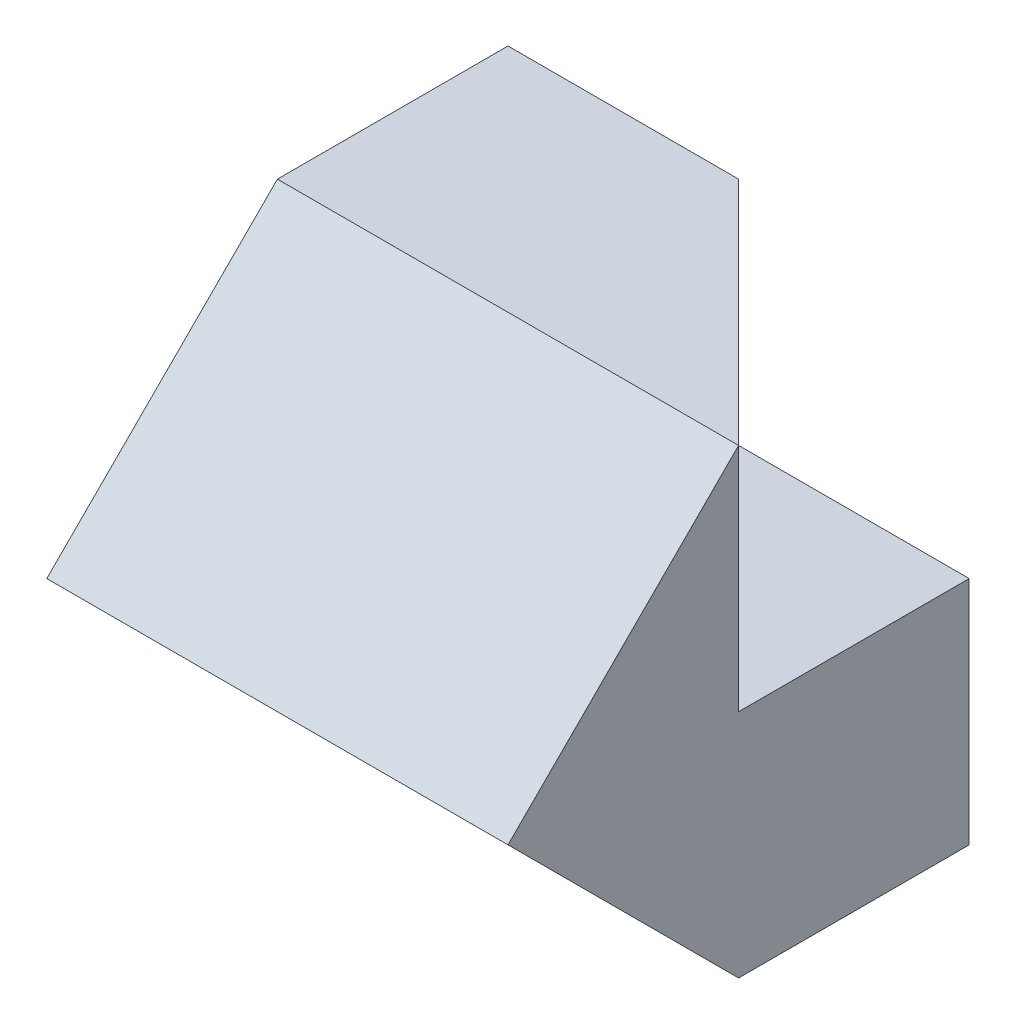
ISO-10303-21;
HEADER;
FILE_DESCRIPTION(('STEP AP214'),'2;1');
FILE_NAME('part.step','',(''),(''),'','','');
FILE_SCHEMA(('AUTOMOTIVE_DESIGN { 1 0 10303 214 1 1 1 1 }'));
ENDSEC;
DATA;
#1=APPLICATION_CONTEXT('core data for automotive mechanical design processes');
#2=APPLICATION_PROTOCOL_DEFINITION('international standard','automotive_design',2000,#1);
#3=PRODUCT_CONTEXT('',#1,'mechanical');
#4=PRODUCT('Part','Part','',(#3));
#5=PRODUCT_RELATED_PRODUCT_CATEGORY('part','',(#4));
#6=PRODUCT_DEFINITION_FORMATION('','',#4);
#7=PRODUCT_DEFINITION_CONTEXT('part definition',#1,'design');
#8=PRODUCT_DEFINITION('design','',#6,#7);
#9=PRODUCT_DEFINITION_SHAPE('','',#8);
#10=(LENGTH_UNIT() NAMED_UNIT(*) SI_UNIT(.MILLI.,.METRE.));
#11=(NAMED_UNIT(*) PLANE_ANGLE_UNIT() SI_UNIT($,.RADIAN.));
#12=(NAMED_UNIT(*) SI_UNIT($,.STERADIAN.) SOLID_ANGLE_UNIT());
#13=UNCERTAINTY_MEASURE_WITH_UNIT(LENGTH_MEASURE(1.E-05),#10,'distance_accuracy_value','');
#14=(GEOMETRIC_REPRESENTATION_CONTEXT(3) GLOBAL_UNCERTAINTY_ASSIGNED_CONTEXT((#13)) GLOBAL_UNIT_ASSIGNED_CONTEXT((#10,
#11,#12)) REPRESENTATION_CONTEXT('',''));
#15=CARTESIAN_POINT('',(0.,0.,0.));
#16=DIRECTION('',(0.,0.,1.));
#17=DIRECTION('',(1.,0.,0.));
#18=AXIS2_PLACEMENT_3D('',#15,#16,#17);
#19=CARTESIAN_POINT('',(0.,0.,0.));
#20=DIRECTION('',(0.,0.,-1.));
#21=DIRECTION('',(-1.,0.,0.));
#22=AXIS2_PLACEMENT_3D('',#19,#20,#21);
#23=PLANE('',#22);
#24=DIRECTION('',(0.,-1.,0.));
#25=VECTOR('',#24,1.);
#26=CARTESIAN_POINT('',(0.,0.,0.));
#27=LINE('',#26,#25);
#28=CARTESIAN_POINT('',(0.,2.,0.));
#29=VERTEX_POINT('',#28);
#30=CARTESIAN_POINT('',(0.,0.,0.));
#31=VERTEX_POINT('',#30);
#32=EDGE_CURVE('E101',#29,#31,#27,.T.);
#33=ORIENTED_EDGE('',*,*,#32,.F.);
#34=DIRECTION('',(-1.,0.,0.));
#35=VECTOR('',#34,1.);
#36=CARTESIAN_POINT('',(0.,2.,0.));
#37=LINE('',#36,#35);
#38=CARTESIAN_POINT('',(2.,2.,0.));
#39=VERTEX_POINT('',#38);
#40=EDGE_CURVE('E123',#39,#29,#37,.T.);
#41=ORIENTED_EDGE('',*,*,#40,.F.);
#42=DIRECTION('',(0.,1.,0.));
#43=VECTOR('',#42,1.);
#44=CARTESIAN_POINT('',(2.,4.,0.));
#45=LINE('',#44,#43);
#46=CARTESIAN_POINT('',(2.,0.,0.));
#47=VERTEX_POINT('',#46);
#48=EDGE_CURVE('E127',#47,#39,#45,.T.);
#49=ORIENTED_EDGE('',*,*,#48,.F.);
#50=DIRECTION('',(1.,0.,0.));
#51=VECTOR('',#50,1.);
#52=CARTESIAN_POINT('',(2.,0.,0.));
#53=LINE('',#52,#51);
#54=EDGE_CURVE('E126',#31,#47,#53,.T.);
#55=ORIENTED_EDGE('',*,*,#54,.F.);
#56=EDGE_LOOP('',(#33,#41,#49,#55));
#57=FACE_BOUND('',#56,.T.);
#58=ADVANCED_FACE('F34',(#57),#23,.T.);
#59=CARTESIAN_POINT('',(2.,0.,4.));
#60=DIRECTION('',(0.,1.,0.));
#61=DIRECTION('',(-1.,0.,0.));
#62=AXIS2_PLACEMENT_3D('',#59,#60,#61);
#63=PLANE('',#62);
#64=DIRECTION('',(0.,0.,-1.));
#65=VECTOR('',#64,1.);
#66=CARTESIAN_POINT('',(2.,0.,4.));
#67=LINE('',#66,#65);
#68=CARTESIAN_POINT('',(2.,0.,2.));
#69=VERTEX_POINT('',#68);
#70=EDGE_CURVE('E12',#69,#47,#67,.T.);
#71=ORIENTED_EDGE('',*,*,#70,.F.);
#72=DIRECTION('',(-1.,0.,0.));
#73=VECTOR('',#72,1.);
#74=CARTESIAN_POINT('',(2.,0.,2.));
#75=LINE('',#74,#73);
#76=CARTESIAN_POINT('',(0.,0.,2.));
#77=VERTEX_POINT('',#76);
#78=EDGE_CURVE('E167',#69,#77,#75,.T.);
#79=ORIENTED_EDGE('',*,*,#78,.T.);
#80=DIRECTION('',(0.,0.,-1.));
#81=VECTOR('',#80,1.);
#82=CARTESIAN_POINT('',(0.,0.,4.));
#83=LINE('',#82,#81);
#84=EDGE_CURVE('E107',#77,#31,#83,.T.);
#85=ORIENTED_EDGE('',*,*,#84,.T.);
#86=ORIENTED_EDGE('',*,*,#54,.T.);
#87=EDGE_LOOP('',(#71,#79,#85,#86));
#88=FACE_BOUND('',#87,.T.);
#89=ADVANCED_FACE('F36',(#88),#63,.F.);
#90=CARTESIAN_POINT('',(2.,4.,4.));
#91=DIRECTION('',(-1.,0.,0.));
#92=DIRECTION('',(0.,-1.,0.));
#93=AXIS2_PLACEMENT_3D('',#90,#91,#92);
#94=PLANE('',#93);
#95=DIRECTION('',(0.,0.,-1.));
#96=VECTOR('',#95,1.);
#97=CARTESIAN_POINT('',(2.,2.,0.));
#98=LINE('',#97,#96);
#99=CARTESIAN_POINT('',(2.,2.,2.));
#100=VERTEX_POINT('',#99);
#101=EDGE_CURVE('E49',#100,#39,#98,.T.);
#102=ORIENTED_EDGE('',*,*,#101,.F.);
#103=DIRECTION('',(0.,1.,0.));
#104=VECTOR('',#103,1.);
#105=CARTESIAN_POINT('',(2.,2.,2.));
#106=LINE('',#105,#104);
#107=CARTESIAN_POINT('',(2.,4.,2.));
#108=VERTEX_POINT('',#107);
#109=EDGE_CURVE('E173',#100,#108,#106,.T.);
#110=ORIENTED_EDGE('',*,*,#109,.T.);
#111=DIRECTION('',(0.,-0.707106781186548,0.707106781186548));
#112=VECTOR('',#111,1.);
#113=CARTESIAN_POINT('',(2.,3.,3.));
#114=LINE('',#113,#112);
#115=CARTESIAN_POINT('',(2.,2.,4.));
#116=VERTEX_POINT('',#115);
#117=EDGE_CURVE('E164',#108,#116,#114,.T.);
#118=ORIENTED_EDGE('',*,*,#117,.T.);
#119=DIRECTION('',(0.,-0.707106781186547,-0.707106781186548));
#120=VECTOR('',#119,1.);
#121=CARTESIAN_POINT('',(2.,-1.,1.));
#122=LINE('',#121,#120);
#123=EDGE_CURVE('E159',#116,#69,#122,.T.);
#124=ORIENTED_EDGE('',*,*,#123,.T.);
#125=ORIENTED_EDGE('',*,*,#70,.T.);
#126=ORIENTED_EDGE('',*,*,#48,.T.);
#127=EDGE_LOOP('',(#102,#110,#118,#124,#125,#126));
#128=FACE_BOUND('',#127,.T.);
#129=ADVANCED_FACE('F185',(#128),#94,.F.);
#130=CARTESIAN_POINT('',(-2.,4.,4.));
#131=DIRECTION('',(0.,-1.,0.));
#132=DIRECTION('',(0.,0.,-1.));
#133=AXIS2_PLACEMENT_3D('',#130,#131,#132);
#134=PLANE('',#133);
#135=DIRECTION('',(-1.,0.,0.));
#136=VECTOR('',#135,1.);
#137=CARTESIAN_POINT('',(2.,4.,2.));
#138=LINE('',#137,#136);
#139=CARTESIAN_POINT('',(-2.,4.,2.));
#140=VERTEX_POINT('',#139);
#141=EDGE_CURVE('E134',#108,#140,#138,.T.);
#142=ORIENTED_EDGE('',*,*,#141,.F.);
#143=DIRECTION('',(0.707106781186548,0.,0.707106781186547));
#144=VECTOR('',#143,1.);
#145=CARTESIAN_POINT('',(2.,4.,2.));
#146=LINE('',#145,#144);
#147=CARTESIAN_POINT('',(0.,4.,0.));
#148=VERTEX_POINT('',#147);
#149=EDGE_CURVE('E144',#148,#108,#146,.T.);
#150=ORIENTED_EDGE('',*,*,#149,.F.);
#151=DIRECTION('',(-1.,0.,0.));
#152=VECTOR('',#151,1.);
#153=CARTESIAN_POINT('',(-2.,4.,0.));
#154=LINE('',#153,#152);
#155=CARTESIAN_POINT('',(-2.,4.,0.));
#156=VERTEX_POINT('',#155);
#157=EDGE_CURVE('E86',#148,#156,#154,.T.);
#158=ORIENTED_EDGE('',*,*,#157,.T.);
#159=DIRECTION('',(0.,0.,-1.));
#160=VECTOR('',#159,1.);
#161=CARTESIAN_POINT('',(-2.,4.,4.));
#162=LINE('',#161,#160);
#163=EDGE_CURVE('E42',#140,#156,#162,.T.);
#164=ORIENTED_EDGE('',*,*,#163,.F.);
#165=EDGE_LOOP('',(#142,#150,#158,#164));
#166=FACE_BOUND('',#165,.T.);
#167=ADVANCED_FACE('F141',(#166),#134,.F.);
#168=CARTESIAN_POINT('',(-2.,2.,4.));
#169=DIRECTION('',(1.,0.,0.));
#170=DIRECTION('',(0.,0.,-1.));
#171=AXIS2_PLACEMENT_3D('',#168,#169,#170);
#172=PLANE('',#171);
#173=DIRECTION('',(0.,0.,-1.));
#174=VECTOR('',#173,1.);
#175=CARTESIAN_POINT('',(-2.,2.,4.));
#176=LINE('',#175,#174);
#177=CARTESIAN_POINT('',(-2.,2.,4.));
#178=VERTEX_POINT('',#177);
#179=CARTESIAN_POINT('',(-2.,2.,0.));
#180=VERTEX_POINT('',#179);
#181=EDGE_CURVE('E79',#178,#180,#176,.T.);
#182=ORIENTED_EDGE('',*,*,#181,.F.);
#183=DIRECTION('',(0.,-0.707106781186548,0.707106781186548));
#184=VECTOR('',#183,1.);
#185=CARTESIAN_POINT('',(-2.,3.,3.));
#186=LINE('',#185,#184);
#187=EDGE_CURVE('E58',#140,#178,#186,.T.);
#188=ORIENTED_EDGE('',*,*,#187,.F.);
#189=ORIENTED_EDGE('',*,*,#163,.T.);
#190=DIRECTION('',(0.,-1.,0.));
#191=VECTOR('',#190,1.);
#192=CARTESIAN_POINT('',(-2.,2.,0.));
#193=LINE('',#192,#191);
#194=EDGE_CURVE('E76',#156,#180,#193,.T.);
#195=ORIENTED_EDGE('',*,*,#194,.T.);
#196=EDGE_LOOP('',(#182,#188,#189,#195));
#197=FACE_BOUND('',#196,.T.);
#198=ADVANCED_FACE('F78',(#197),#172,.F.);
#199=CARTESIAN_POINT('',(0.,2.,4.));
#200=DIRECTION('',(0.,1.,0.));
#201=DIRECTION('',(-1.,0.,0.));
#202=AXIS2_PLACEMENT_3D('',#199,#200,#201);
#203=PLANE('',#202);
#204=DIRECTION('',(1.,0.,0.));
#205=VECTOR('',#204,1.);
#206=CARTESIAN_POINT('',(0.,2.,0.));
#207=LINE('',#206,#205);
#208=EDGE_CURVE('E85',#180,#29,#207,.T.);
#209=ORIENTED_EDGE('',*,*,#208,.T.);
#210=DIRECTION('',(0.,0.,-1.));
#211=VECTOR('',#210,1.);
#212=CARTESIAN_POINT('',(0.,2.,4.));
#213=LINE('',#212,#211);
#214=CARTESIAN_POINT('',(0.,2.,4.));
#215=VERTEX_POINT('',#214);
#216=EDGE_CURVE('E95',#215,#29,#213,.T.);
#217=ORIENTED_EDGE('',*,*,#216,.F.);
#218=DIRECTION('',(1.,0.,0.));
#219=VECTOR('',#218,1.);
#220=CARTESIAN_POINT('',(0.,2.,4.));
#221=LINE('',#220,#219);
#222=EDGE_CURVE('E94',#178,#215,#221,.T.);
#223=ORIENTED_EDGE('',*,*,#222,.F.);
#224=ORIENTED_EDGE('',*,*,#181,.T.);
#225=EDGE_LOOP('',(#209,#217,#223,#224));
#226=FACE_BOUND('',#225,.T.);
#227=ADVANCED_FACE('F90',(#226),#203,.F.);
#228=CARTESIAN_POINT('',(0.,0.,4.));
#229=DIRECTION('',(1.,0.,0.));
#230=DIRECTION('',(0.,0.,-1.));
#231=AXIS2_PLACEMENT_3D('',#228,#229,#230);
#232=PLANE('',#231);
#233=ORIENTED_EDGE('',*,*,#84,.F.);
#234=DIRECTION('',(0.,0.707106781186547,0.707106781186548));
#235=VECTOR('',#234,1.);
#236=CARTESIAN_POINT('',(0.,1.,3.));
#237=LINE('',#236,#235);
#238=EDGE_CURVE('E117',#77,#215,#237,.T.);
#239=ORIENTED_EDGE('',*,*,#238,.T.);
#240=ORIENTED_EDGE('',*,*,#216,.T.);
#241=ORIENTED_EDGE('',*,*,#32,.T.);
#242=EDGE_LOOP('',(#233,#239,#240,#241));
#243=FACE_BOUND('',#242,.T.);
#244=ADVANCED_FACE('F113',(#243),#232,.F.);
#245=DIRECTION('',(0.,1.,0.));
#246=VECTOR('',#245,1.);
#247=CARTESIAN_POINT('',(0.,2.,0.));
#248=LINE('',#247,#246);
#249=EDGE_CURVE('E100',#29,#148,#248,.T.);
#250=ORIENTED_EDGE('',*,*,#249,.F.);
#251=ORIENTED_EDGE('',*,*,#208,.F.);
#252=ORIENTED_EDGE('',*,*,#194,.F.);
#253=ORIENTED_EDGE('',*,*,#157,.F.);
#254=EDGE_LOOP('',(#250,#251,#252,#253));
#255=FACE_BOUND('',#254,.T.);
#256=ADVANCED_FACE('F98',(#255),#23,.T.);
#257=CARTESIAN_POINT('',(2.,3.,3.));
#258=DIRECTION('',(0.,-0.707106781186547,-0.707106781186547));
#259=DIRECTION('',(0.,0.707106781186548,-0.707106781186548));
#260=AXIS2_PLACEMENT_3D('',#257,#258,#259);
#261=PLANE('',#260);
#262=ORIENTED_EDGE('',*,*,#187,.T.);
#263=ORIENTED_EDGE('',*,*,#222,.T.);
#264=DIRECTION('',(-1.,0.,0.));
#265=VECTOR('',#264,1.);
#266=CARTESIAN_POINT('',(2.,2.,4.));
#267=LINE('',#266,#265);
#268=EDGE_CURVE('E130',#116,#215,#267,.T.);
#269=ORIENTED_EDGE('',*,*,#268,.F.);
#270=ORIENTED_EDGE('',*,*,#117,.F.);
#271=ORIENTED_EDGE('',*,*,#141,.T.);
#272=EDGE_LOOP('',(#262,#263,#269,#270,#271));
#273=FACE_BOUND('',#272,.T.);
#274=ADVANCED_FACE('F162',(#273),#261,.F.);
#275=CARTESIAN_POINT('',(2.,-1.,1.));
#276=DIRECTION('',(0.,0.707106781186548,-0.707106781186547));
#277=DIRECTION('',(0.,0.707106781186547,0.707106781186548));
#278=AXIS2_PLACEMENT_3D('',#275,#276,#277);
#279=PLANE('',#278);
#280=ORIENTED_EDGE('',*,*,#78,.F.);
#281=ORIENTED_EDGE('',*,*,#123,.F.);
#282=ORIENTED_EDGE('',*,*,#268,.T.);
#283=ORIENTED_EDGE('',*,*,#238,.F.);
#284=EDGE_LOOP('',(#280,#281,#282,#283));
#285=FACE_BOUND('',#284,.T.);
#286=ADVANCED_FACE('F186',(#285),#279,.F.);
#287=CARTESIAN_POINT('',(2.,2.,2.));
#288=DIRECTION('',(-0.707106781186547,0.,0.707106781186548));
#289=DIRECTION('',(0.707106781186548,0.,0.707106781186547));
#290=AXIS2_PLACEMENT_3D('',#287,#288,#289);
#291=PLANE('',#290);
#292=ORIENTED_EDGE('',*,*,#149,.T.);
#293=ORIENTED_EDGE('',*,*,#109,.F.);
#294=DIRECTION('',(0.707106781186548,0.,0.707106781186547));
#295=VECTOR('',#294,1.);
#296=CARTESIAN_POINT('',(2.,2.,2.));
#297=LINE('',#296,#295);
#298=EDGE_CURVE('E175',#29,#100,#297,.T.);
#299=ORIENTED_EDGE('',*,*,#298,.F.);
#300=ORIENTED_EDGE('',*,*,#249,.T.);
#301=EDGE_LOOP('',(#292,#293,#299,#300));
#302=FACE_BOUND('',#301,.T.);
#303=ADVANCED_FACE('F183',(#302),#291,.F.);
#304=CARTESIAN_POINT('',(0.,2.,0.));
#305=DIRECTION('',(0.,1.,0.));
#306=DIRECTION('',(0.,0.,1.));
#307=AXIS2_PLACEMENT_3D('',#304,#305,#306);
#308=PLANE('',#307);
#309=ORIENTED_EDGE('',*,*,#101,.T.);
#310=ORIENTED_EDGE('',*,*,#40,.T.);
#311=ORIENTED_EDGE('',*,*,#298,.T.);
#312=EDGE_LOOP('',(#309,#310,#311));
#313=FACE_BOUND('',#312,.T.);
#314=ADVANCED_FACE('F181',(#313),#308,.T.);
#315=CLOSED_SHELL('',(#58,#89,#129,#167,#198,#227,#244,#256,#274,#286,#303,#314));
#316=MANIFOLD_SOLID_BREP('B2',#315);
#317=ADVANCED_BREP_SHAPE_REPRESENTATION('',(#18,#316),#14);
#318=SHAPE_DEFINITION_REPRESENTATION(#9,#317);
ENDSEC;
END-ISO-10303-21;
